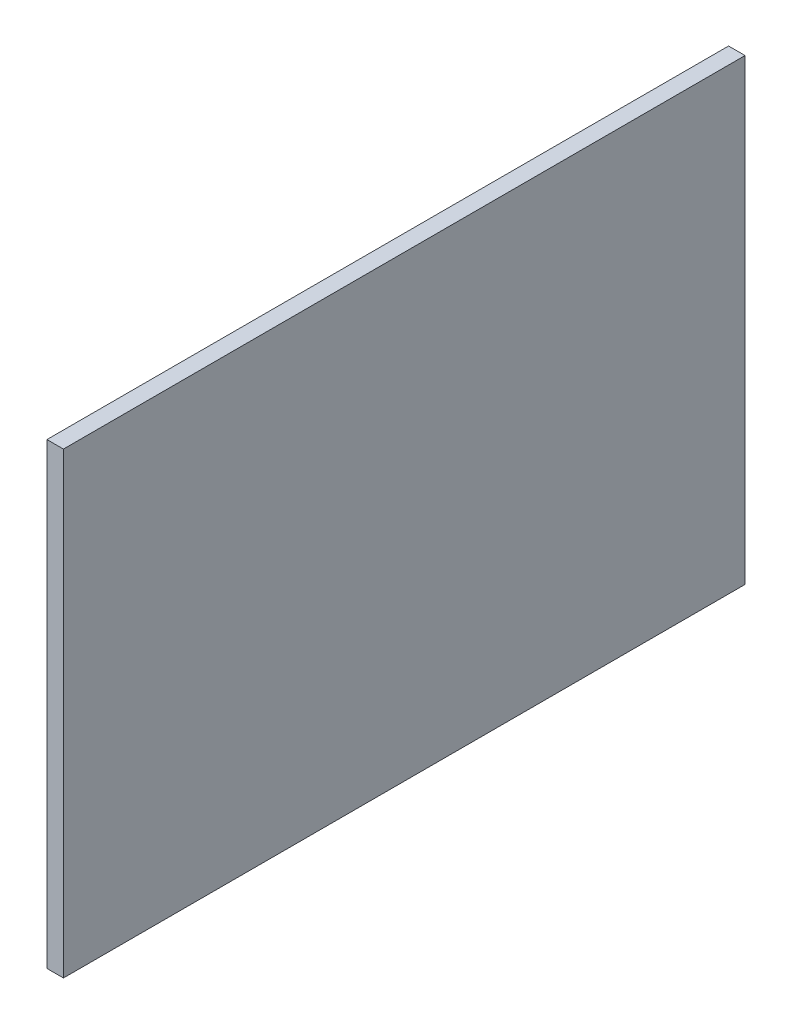
ISO-10303-21;
HEADER;
FILE_DESCRIPTION(('STEP AP214'),'2;1');
FILE_NAME('part.step','',(''),(''),'','','');
FILE_SCHEMA(('AUTOMOTIVE_DESIGN { 1 0 10303 214 1 1 1 1 }'));
ENDSEC;
DATA;
#1=APPLICATION_CONTEXT('core data for automotive mechanical design processes');
#2=APPLICATION_PROTOCOL_DEFINITION('international standard','automotive_design',2000,#1);
#3=PRODUCT_CONTEXT('',#1,'mechanical');
#4=PRODUCT('Part','Part','',(#3));
#5=PRODUCT_RELATED_PRODUCT_CATEGORY('part','',(#4));
#6=PRODUCT_DEFINITION_FORMATION('','',#4);
#7=PRODUCT_DEFINITION_CONTEXT('part definition',#1,'design');
#8=PRODUCT_DEFINITION('design','',#6,#7);
#9=PRODUCT_DEFINITION_SHAPE('','',#8);
#10=(LENGTH_UNIT() NAMED_UNIT(*) SI_UNIT(.MILLI.,.METRE.));
#11=(NAMED_UNIT(*) PLANE_ANGLE_UNIT() SI_UNIT($,.RADIAN.));
#12=(NAMED_UNIT(*) SI_UNIT($,.STERADIAN.) SOLID_ANGLE_UNIT());
#13=UNCERTAINTY_MEASURE_WITH_UNIT(LENGTH_MEASURE(1.E-05),#10,'distance_accuracy_value','');
#14=(GEOMETRIC_REPRESENTATION_CONTEXT(3) GLOBAL_UNCERTAINTY_ASSIGNED_CONTEXT((#13)) GLOBAL_UNIT_ASSIGNED_CONTEXT((#10,
#11,#12)) REPRESENTATION_CONTEXT('',''));
#15=CARTESIAN_POINT('',(0.,0.,0.));
#16=DIRECTION('',(0.,0.,1.));
#17=DIRECTION('',(1.,0.,0.));
#18=AXIS2_PLACEMENT_3D('',#15,#16,#17);
#19=CARTESIAN_POINT('',(18.,-465.924952068349,-669.946474068496));
#20=DIRECTION('',(0.,0.,1.));
#21=DIRECTION('',(1.,0.,0.));
#22=AXIS2_PLACEMENT_3D('',#19,#20,#21);
#23=PLANE('',#22);
#24=DIRECTION('',(0.,1.,0.));
#25=VECTOR('',#24,1.);
#26=CARTESIAN_POINT('',(0.,-465.924952068349,-669.946474068496));
#27=LINE('',#26,#25);
#28=CARTESIAN_POINT('',(0.,-465.924952068349,-669.946474068496));
#29=VERTEX_POINT('',#28);
#30=CARTESIAN_POINT('',(0.,34.0750479316512,-669.946474068496));
#31=VERTEX_POINT('',#30);
#32=EDGE_CURVE('E95',#29,#31,#27,.T.);
#33=ORIENTED_EDGE('',*,*,#32,.T.);
#34=DIRECTION('',(-1.,0.,0.));
#35=VECTOR('',#34,1.);
#36=CARTESIAN_POINT('',(18.,34.0750479316512,-669.946474068496));
#37=LINE('',#36,#35);
#38=CARTESIAN_POINT('',(18.,34.0750479316512,-669.946474068496));
#39=VERTEX_POINT('',#38);
#40=EDGE_CURVE('E11',#39,#31,#37,.T.);
#41=ORIENTED_EDGE('',*,*,#40,.F.);
#42=DIRECTION('',(0.,1.,0.));
#43=VECTOR('',#42,1.);
#44=CARTESIAN_POINT('',(18.,-465.924952068349,-669.946474068496));
#45=LINE('',#44,#43);
#46=CARTESIAN_POINT('',(18.,-465.924952068349,-669.946474068496));
#47=VERTEX_POINT('',#46);
#48=EDGE_CURVE('E83',#47,#39,#45,.T.);
#49=ORIENTED_EDGE('',*,*,#48,.F.);
#50=DIRECTION('',(-1.,0.,0.));
#51=VECTOR('',#50,1.);
#52=CARTESIAN_POINT('',(18.,-465.924952068349,-669.946474068496));
#53=LINE('',#52,#51);
#54=EDGE_CURVE('E91',#47,#29,#53,.T.);
#55=ORIENTED_EDGE('',*,*,#54,.T.);
#56=EDGE_LOOP('',(#33,#41,#49,#55));
#57=FACE_BOUND('',#56,.T.);
#58=ADVANCED_FACE('F32',(#57),#23,.F.);
#59=CARTESIAN_POINT('',(18.,34.0750479316512,74.0535259315038));
#60=DIRECTION('',(0.,-1.,0.));
#61=DIRECTION('',(0.,0.,-1.));
#62=AXIS2_PLACEMENT_3D('',#59,#60,#61);
#63=PLANE('',#62);
#64=DIRECTION('',(0.,0.,1.));
#65=VECTOR('',#64,1.);
#66=CARTESIAN_POINT('',(0.,34.0750479316512,74.0535259315038));
#67=LINE('',#66,#65);
#68=CARTESIAN_POINT('',(0.,34.0750479316512,74.0535259315038));
#69=VERTEX_POINT('',#68);
#70=EDGE_CURVE('E87',#31,#69,#67,.T.);
#71=ORIENTED_EDGE('',*,*,#70,.T.);
#72=DIRECTION('',(-1.,0.,0.));
#73=VECTOR('',#72,1.);
#74=CARTESIAN_POINT('',(18.,34.0750479316512,74.0535259315038));
#75=LINE('',#74,#73);
#76=CARTESIAN_POINT('',(18.,34.0750479316512,74.0535259315038));
#77=VERTEX_POINT('',#76);
#78=EDGE_CURVE('E40',#77,#69,#75,.T.);
#79=ORIENTED_EDGE('',*,*,#78,.F.);
#80=DIRECTION('',(0.,0.,1.));
#81=VECTOR('',#80,1.);
#82=CARTESIAN_POINT('',(18.,34.0750479316512,74.0535259315038));
#83=LINE('',#82,#81);
#84=EDGE_CURVE('E78',#39,#77,#83,.T.);
#85=ORIENTED_EDGE('',*,*,#84,.F.);
#86=ORIENTED_EDGE('',*,*,#40,.T.);
#87=EDGE_LOOP('',(#71,#79,#85,#86));
#88=FACE_BOUND('',#87,.T.);
#89=ADVANCED_FACE('F86',(#88),#63,.F.);
#90=CARTESIAN_POINT('',(18.,-465.924952068349,74.0535259315038));
#91=DIRECTION('',(0.,0.,-1.));
#92=DIRECTION('',(-1.,0.,0.));
#93=AXIS2_PLACEMENT_3D('',#90,#91,#92);
#94=PLANE('',#93);
#95=DIRECTION('',(0.,-1.,0.));
#96=VECTOR('',#95,1.);
#97=CARTESIAN_POINT('',(0.,-465.924952068349,74.0535259315038));
#98=LINE('',#97,#96);
#99=CARTESIAN_POINT('',(0.,-465.924952068349,74.0535259315038));
#100=VERTEX_POINT('',#99);
#101=EDGE_CURVE('E65',#69,#100,#98,.T.);
#102=ORIENTED_EDGE('',*,*,#101,.T.);
#103=DIRECTION('',(-1.,0.,0.));
#104=VECTOR('',#103,1.);
#105=CARTESIAN_POINT('',(18.,-465.924952068349,74.0535259315038));
#106=LINE('',#105,#104);
#107=CARTESIAN_POINT('',(18.,-465.924952068349,74.0535259315038));
#108=VERTEX_POINT('',#107);
#109=EDGE_CURVE('E88',#108,#100,#106,.T.);
#110=ORIENTED_EDGE('',*,*,#109,.F.);
#111=DIRECTION('',(0.,-1.,0.));
#112=VECTOR('',#111,1.);
#113=CARTESIAN_POINT('',(18.,-465.924952068349,74.0535259315038));
#114=LINE('',#113,#112);
#115=EDGE_CURVE('E81',#77,#108,#114,.T.);
#116=ORIENTED_EDGE('',*,*,#115,.F.);
#117=ORIENTED_EDGE('',*,*,#78,.T.);
#118=EDGE_LOOP('',(#102,#110,#116,#117));
#119=FACE_BOUND('',#118,.T.);
#120=ADVANCED_FACE('F89',(#119),#94,.F.);
#121=CARTESIAN_POINT('',(18.,-465.924952068349,74.0535259315038));
#122=DIRECTION('',(0.,1.,0.));
#123=DIRECTION('',(0.,0.,1.));
#124=AXIS2_PLACEMENT_3D('',#121,#122,#123);
#125=PLANE('',#124);
#126=DIRECTION('',(0.,0.,-1.));
#127=VECTOR('',#126,1.);
#128=CARTESIAN_POINT('',(0.,-465.924952068349,74.0535259315038));
#129=LINE('',#128,#127);
#130=EDGE_CURVE('E71',#100,#29,#129,.T.);
#131=ORIENTED_EDGE('',*,*,#130,.T.);
#132=ORIENTED_EDGE('',*,*,#54,.F.);
#133=DIRECTION('',(0.,0.,-1.));
#134=VECTOR('',#133,1.);
#135=CARTESIAN_POINT('',(18.,-465.924952068349,74.0535259315038));
#136=LINE('',#135,#134);
#137=EDGE_CURVE('E48',#108,#47,#136,.T.);
#138=ORIENTED_EDGE('',*,*,#137,.F.);
#139=ORIENTED_EDGE('',*,*,#109,.T.);
#140=EDGE_LOOP('',(#131,#132,#138,#139));
#141=FACE_BOUND('',#140,.T.);
#142=ADVANCED_FACE('F102',(#141),#125,.F.);
#143=CARTESIAN_POINT('',(18.,0.,0.));
#144=DIRECTION('',(-1.,0.,0.));
#145=DIRECTION('',(0.,0.,1.));
#146=AXIS2_PLACEMENT_3D('',#143,#144,#145);
#147=PLANE('',#146);
#148=ORIENTED_EDGE('',*,*,#48,.T.);
#149=ORIENTED_EDGE('',*,*,#84,.T.);
#150=ORIENTED_EDGE('',*,*,#115,.T.);
#151=ORIENTED_EDGE('',*,*,#137,.T.);
#152=EDGE_LOOP('',(#148,#149,#150,#151));
#153=FACE_BOUND('',#152,.T.);
#154=ADVANCED_FACE('F79',(#153),#147,.F.);
#155=CARTESIAN_POINT('',(0.,0.,0.));
#156=DIRECTION('',(-1.,0.,0.));
#157=DIRECTION('',(0.,0.,1.));
#158=AXIS2_PLACEMENT_3D('',#155,#156,#157);
#159=PLANE('',#158);
#160=ORIENTED_EDGE('',*,*,#32,.F.);
#161=ORIENTED_EDGE('',*,*,#130,.F.);
#162=ORIENTED_EDGE('',*,*,#101,.F.);
#163=ORIENTED_EDGE('',*,*,#70,.F.);
#164=EDGE_LOOP('',(#160,#161,#162,#163));
#165=FACE_BOUND('',#164,.T.);
#166=ADVANCED_FACE('F105',(#165),#159,.T.);
#167=CLOSED_SHELL('',(#58,#89,#120,#142,#154,#166));
#168=MANIFOLD_SOLID_BREP('B2',#167);
#169=ADVANCED_BREP_SHAPE_REPRESENTATION('',(#18,#168),#14);
#170=SHAPE_DEFINITION_REPRESENTATION(#9,#169);
ENDSEC;
END-ISO-10303-21;
